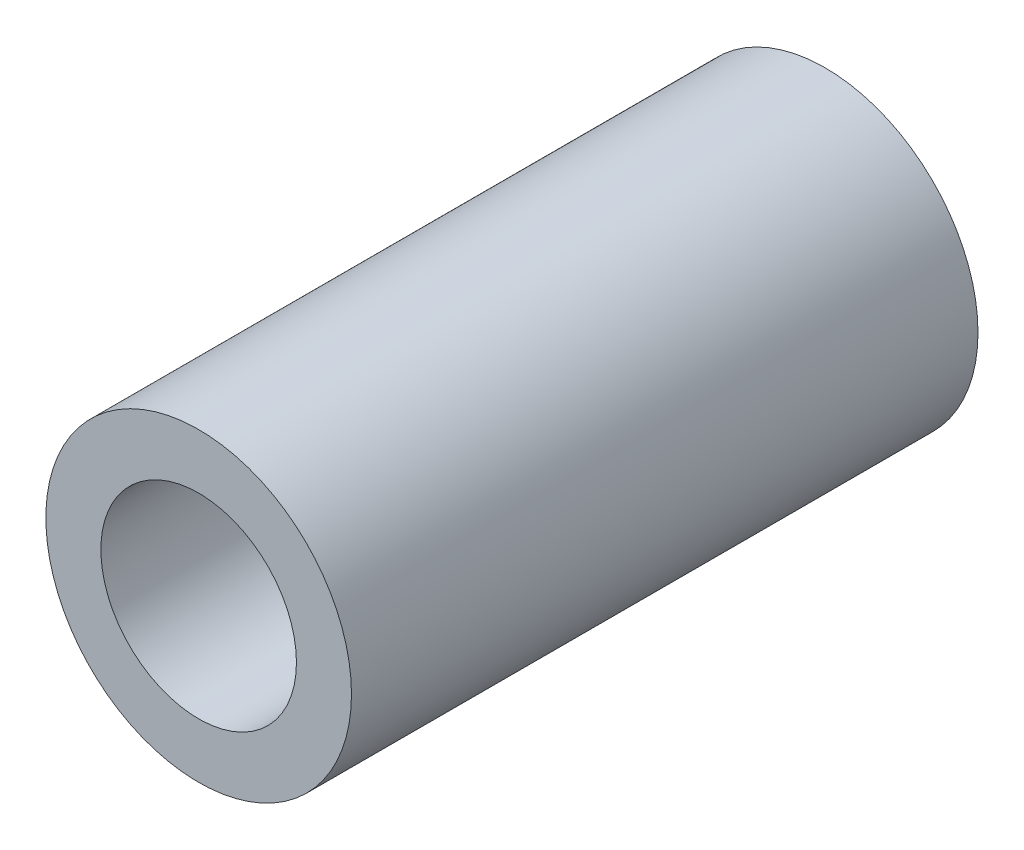
ISO-10303-21;
HEADER;
FILE_DESCRIPTION(('STEP AP214'),'2;1');
FILE_NAME('part.step','',(''),(''),'','','');
FILE_SCHEMA(('AUTOMOTIVE_DESIGN { 1 0 10303 214 1 1 1 1 }'));
ENDSEC;
DATA;
#1=APPLICATION_CONTEXT('core data for automotive mechanical design processes');
#2=APPLICATION_PROTOCOL_DEFINITION('international standard','automotive_design',2000,#1);
#3=PRODUCT_CONTEXT('',#1,'mechanical');
#4=PRODUCT('Part','Part','',(#3));
#5=PRODUCT_RELATED_PRODUCT_CATEGORY('part','',(#4));
#6=PRODUCT_DEFINITION_FORMATION('','',#4);
#7=PRODUCT_DEFINITION_CONTEXT('part definition',#1,'design');
#8=PRODUCT_DEFINITION('design','',#6,#7);
#9=PRODUCT_DEFINITION_SHAPE('','',#8);
#10=(LENGTH_UNIT() NAMED_UNIT(*) SI_UNIT(.MILLI.,.METRE.));
#11=(NAMED_UNIT(*) PLANE_ANGLE_UNIT() SI_UNIT($,.RADIAN.));
#12=(NAMED_UNIT(*) SI_UNIT($,.STERADIAN.) SOLID_ANGLE_UNIT());
#13=UNCERTAINTY_MEASURE_WITH_UNIT(LENGTH_MEASURE(1.E-05),#10,'distance_accuracy_value','');
#14=(GEOMETRIC_REPRESENTATION_CONTEXT(3) GLOBAL_UNCERTAINTY_ASSIGNED_CONTEXT((#13)) GLOBAL_UNIT_ASSIGNED_CONTEXT((#10,
#11,#12)) REPRESENTATION_CONTEXT('',''));
#15=CARTESIAN_POINT('',(0.,0.,0.));
#16=DIRECTION('',(0.,0.,1.));
#17=DIRECTION('',(1.,0.,0.));
#18=AXIS2_PLACEMENT_3D('',#15,#16,#17);
#19=CARTESIAN_POINT('',(0.,0.,20.5));
#20=DIRECTION('',(0.,0.,1.));
#21=DIRECTION('',(1.,0.,0.));
#22=AXIS2_PLACEMENT_3D('',#19,#20,#21);
#23=PLANE('',#22);
#24=CARTESIAN_POINT('',(0.,0.,20.5));
#25=DIRECTION('',(0.,0.,1.));
#26=DIRECTION('',(1.,0.,0.));
#27=AXIS2_PLACEMENT_3D('',#24,#25,#26);
#28=CIRCLE('',#27,5.);
#29=CARTESIAN_POINT('',(5.,0.,20.5));
#30=VERTEX_POINT('',#29);
#31=EDGE_CURVE('E10',#30,#30,#28,.T.);
#32=ORIENTED_EDGE('',*,*,#31,.T.);
#33=EDGE_LOOP('',(#32));
#34=FACE_BOUND('',#33,.T.);
#35=CARTESIAN_POINT('',(0.,0.,20.5));
#36=DIRECTION('',(0.,0.,1.));
#37=DIRECTION('',(1.,0.,0.));
#38=AXIS2_PLACEMENT_3D('',#35,#36,#37);
#39=CIRCLE('',#38,3.2);
#40=CARTESIAN_POINT('',(3.2,0.,20.5));
#41=VERTEX_POINT('',#40);
#42=EDGE_CURVE('E44',#41,#41,#39,.T.);
#43=ORIENTED_EDGE('',*,*,#42,.F.);
#44=EDGE_LOOP('',(#43));
#45=FACE_BOUND('',#44,.T.);
#46=ADVANCED_FACE('F33',(#34,#45),#23,.T.);
#47=CARTESIAN_POINT('',(0.,0.,0.));
#48=DIRECTION('',(0.,0.,1.));
#49=DIRECTION('',(1.,0.,0.));
#50=AXIS2_PLACEMENT_3D('',#47,#48,#49);
#51=PLANE('',#50);
#52=CARTESIAN_POINT('',(0.,0.,0.));
#53=DIRECTION('',(0.,0.,1.));
#54=DIRECTION('',(1.,0.,0.));
#55=AXIS2_PLACEMENT_3D('',#52,#53,#54);
#56=CIRCLE('',#55,5.);
#57=CARTESIAN_POINT('',(5.,0.,0.));
#58=VERTEX_POINT('',#57);
#59=EDGE_CURVE('E37',#58,#58,#56,.T.);
#60=ORIENTED_EDGE('',*,*,#59,.F.);
#61=EDGE_LOOP('',(#60));
#62=FACE_BOUND('',#61,.T.);
#63=CARTESIAN_POINT('',(0.,0.,0.));
#64=DIRECTION('',(0.,0.,1.));
#65=DIRECTION('',(1.,0.,0.));
#66=AXIS2_PLACEMENT_3D('',#63,#64,#65);
#67=CIRCLE('',#66,3.2);
#68=CARTESIAN_POINT('',(3.2,0.,0.));
#69=VERTEX_POINT('',#68);
#70=EDGE_CURVE('E46',#69,#69,#67,.T.);
#71=ORIENTED_EDGE('',*,*,#70,.T.);
#72=EDGE_LOOP('',(#71));
#73=FACE_BOUND('',#72,.T.);
#74=ADVANCED_FACE('F56',(#62,#73),#51,.F.);
#75=CARTESIAN_POINT('',(0.,0.,20.5));
#76=DIRECTION('',(0.,0.,-1.));
#77=DIRECTION('',(-1.,0.,0.));
#78=AXIS2_PLACEMENT_3D('',#75,#76,#77);
#79=CYLINDRICAL_SURFACE('',#78,5.);
#80=ORIENTED_EDGE('',*,*,#31,.F.);
#81=EDGE_LOOP('',(#80));
#82=FACE_BOUND('',#81,.T.);
#83=ORIENTED_EDGE('',*,*,#59,.T.);
#84=EDGE_LOOP('',(#83));
#85=FACE_BOUND('',#84,.T.);
#86=ADVANCED_FACE('F35',(#82,#85),#79,.T.);
#87=CARTESIAN_POINT('',(0.,0.,20.5));
#88=DIRECTION('',(0.,0.,-1.));
#89=DIRECTION('',(-1.,0.,0.));
#90=AXIS2_PLACEMENT_3D('',#87,#88,#89);
#91=CYLINDRICAL_SURFACE('',#90,3.2);
#92=ORIENTED_EDGE('',*,*,#42,.T.);
#93=EDGE_LOOP('',(#92));
#94=FACE_BOUND('',#93,.T.);
#95=ORIENTED_EDGE('',*,*,#70,.F.);
#96=EDGE_LOOP('',(#95));
#97=FACE_BOUND('',#96,.T.);
#98=ADVANCED_FACE('F52',(#94,#97),#91,.F.);
#99=CLOSED_SHELL('',(#46,#74,#86,#98));
#100=MANIFOLD_SOLID_BREP('B2',#99);
#101=ADVANCED_BREP_SHAPE_REPRESENTATION('',(#18,#100),#14);
#102=SHAPE_DEFINITION_REPRESENTATION(#9,#101);
ENDSEC;
END-ISO-10303-21;
